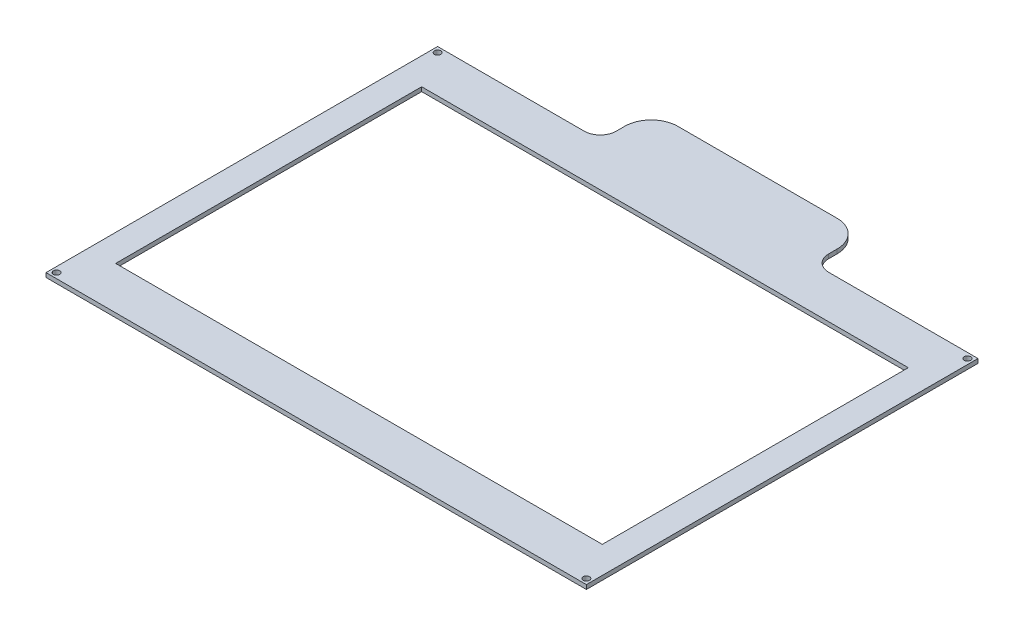
ISO-10303-21;
HEADER;
FILE_DESCRIPTION(('STEP AP214'),'2;1');
FILE_NAME('part.step','',(''),(''),'','','');
FILE_SCHEMA(('AUTOMOTIVE_DESIGN { 1 0 10303 214 1 1 1 1 }'));
ENDSEC;
DATA;
#1=APPLICATION_CONTEXT('core data for automotive mechanical design processes');
#2=APPLICATION_PROTOCOL_DEFINITION('international standard','automotive_design',2000,#1);
#3=PRODUCT_CONTEXT('',#1,'mechanical');
#4=PRODUCT('Part','Part','',(#3));
#5=PRODUCT_RELATED_PRODUCT_CATEGORY('part','',(#4));
#6=PRODUCT_DEFINITION_FORMATION('','',#4);
#7=PRODUCT_DEFINITION_CONTEXT('part definition',#1,'design');
#8=PRODUCT_DEFINITION('design','',#6,#7);
#9=PRODUCT_DEFINITION_SHAPE('','',#8);
#10=(LENGTH_UNIT() NAMED_UNIT(*) SI_UNIT(.MILLI.,.METRE.));
#11=(NAMED_UNIT(*) PLANE_ANGLE_UNIT() SI_UNIT($,.RADIAN.));
#12=(NAMED_UNIT(*) SI_UNIT($,.STERADIAN.) SOLID_ANGLE_UNIT());
#13=UNCERTAINTY_MEASURE_WITH_UNIT(LENGTH_MEASURE(1.E-05),#10,'distance_accuracy_value','');
#14=(GEOMETRIC_REPRESENTATION_CONTEXT(3) GLOBAL_UNCERTAINTY_ASSIGNED_CONTEXT((#13)) GLOBAL_UNIT_ASSIGNED_CONTEXT((#10,
#11,#12)) REPRESENTATION_CONTEXT('',''));
#15=CARTESIAN_POINT('',(0.,0.,0.));
#16=DIRECTION('',(0.,0.,1.));
#17=DIRECTION('',(1.,0.,0.));
#18=AXIS2_PLACEMENT_3D('',#15,#16,#17);
#19=CARTESIAN_POINT('',(-58.1227979298154,2.,-87.6413871869836));
#20=DIRECTION('',(0.,1.,0.));
#21=DIRECTION('',(0.,0.,1.));
#22=AXIS2_PLACEMENT_3D('',#19,#20,#21);
#23=PLANE('',#22);
#24=CARTESIAN_POINT('',(124.667766953022,2.,101.667766953043));
#25=DIRECTION('',(0.,1.,0.));
#26=DIRECTION('',(0.,0.,1.));
#27=AXIS2_PLACEMENT_3D('',#24,#25,#26);
#28=CIRCLE('',#27,1.49999999999998);
#29=CARTESIAN_POINT('',(124.667766953022,2.,103.167766953043));
#30=VERTEX_POINT('',#29);
#31=EDGE_CURVE('E188',#30,#30,#28,.T.);
#32=ORIENTED_EDGE('',*,*,#31,.F.);
#33=EDGE_LOOP('',(#32));
#34=FACE_BOUND('',#33,.T.);
#35=CARTESIAN_POINT('',(-124.667766952911,2.,-77.6591541398728));
#36=DIRECTION('',(0.,1.,0.));
#37=DIRECTION('',(0.,0.,1.));
#38=AXIS2_PLACEMENT_3D('',#35,#36,#37);
#39=CIRCLE('',#38,1.5);
#40=CARTESIAN_POINT('',(-124.667766952911,2.,-76.1591541398728));
#41=VERTEX_POINT('',#40);
#42=EDGE_CURVE('E200',#41,#41,#39,.T.);
#43=ORIENTED_EDGE('',*,*,#42,.F.);
#44=EDGE_LOOP('',(#43));
#45=FACE_BOUND('',#44,.T.);
#46=DIRECTION('',(0.,0.,1.));
#47=VECTOR('',#46,1.);
#48=CARTESIAN_POINT('',(-127.15,2.,104.141387186984));
#49=LINE('',#48,#47);
#50=CARTESIAN_POINT('',(-127.15,2.,-80.1413871869836));
#51=VERTEX_POINT('',#50);
#52=CARTESIAN_POINT('',(-127.15,2.,104.141387186984));
#53=VERTEX_POINT('',#52);
#54=EDGE_CURVE('E206',#51,#53,#49,.T.);
#55=ORIENTED_EDGE('',*,*,#54,.T.);
#56=DIRECTION('',(1.,0.,0.));
#57=VECTOR('',#56,1.);
#58=CARTESIAN_POINT('',(127.15,2.,104.141387186984));
#59=LINE('',#58,#57);
#60=CARTESIAN_POINT('',(127.15,2.,104.141387186984));
#61=VERTEX_POINT('',#60);
#62=EDGE_CURVE('E209',#53,#61,#59,.T.);
#63=ORIENTED_EDGE('',*,*,#62,.T.);
#64=DIRECTION('',(0.,0.,-1.));
#65=VECTOR('',#64,1.);
#66=CARTESIAN_POINT('',(127.15,2.,-80.1413871869836));
#67=LINE('',#66,#65);
#68=CARTESIAN_POINT('',(127.15,2.,-80.1413871869836));
#69=VERTEX_POINT('',#68);
#70=EDGE_CURVE('E212',#61,#69,#67,.T.);
#71=ORIENTED_EDGE('',*,*,#70,.T.);
#72=DIRECTION('',(-1.,0.,0.));
#73=VECTOR('',#72,1.);
#74=CARTESIAN_POINT('',(56.8772020701845,2.,-80.1413871869836));
#75=LINE('',#74,#73);
#76=CARTESIAN_POINT('',(56.8772020701846,2.,-80.1413871869836));
#77=VERTEX_POINT('',#76);
#78=EDGE_CURVE('E214',#69,#77,#75,.T.);
#79=ORIENTED_EDGE('',*,*,#78,.T.);
#80=CARTESIAN_POINT('',(56.8772020701846,2.,-87.6413871869836));
#81=DIRECTION('',(0.,-1.,0.));
#82=DIRECTION('',(0.,0.,1.));
#83=AXIS2_PLACEMENT_3D('',#80,#81,#82);
#84=CIRCLE('',#83,7.50000000000001);
#85=CARTESIAN_POINT('',(49.3772020701845,2.,-87.6413871869836));
#86=VERTEX_POINT('',#85);
#87=EDGE_CURVE('E216',#77,#86,#84,.T.);
#88=ORIENTED_EDGE('',*,*,#87,.T.);
#89=DIRECTION('',(0.,0.,-1.));
#90=VECTOR('',#89,1.);
#91=CARTESIAN_POINT('',(49.3772020701845,2.,-91.6413871869836));
#92=LINE('',#91,#90);
#93=CARTESIAN_POINT('',(49.3772020701846,2.,-91.6413871869836));
#94=VERTEX_POINT('',#93);
#95=EDGE_CURVE('E218',#86,#94,#92,.T.);
#96=ORIENTED_EDGE('',*,*,#95,.T.);
#97=CARTESIAN_POINT('',(36.8772020701846,2.,-91.6413871869836));
#98=DIRECTION('',(0.,1.,0.));
#99=DIRECTION('',(0.,0.,-1.));
#100=AXIS2_PLACEMENT_3D('',#97,#98,#99);
#101=CIRCLE('',#100,12.5);
#102=CARTESIAN_POINT('',(36.8772020701846,2.,-104.141387186984));
#103=VERTEX_POINT('',#102);
#104=EDGE_CURVE('E220',#94,#103,#101,.T.);
#105=ORIENTED_EDGE('',*,*,#104,.T.);
#106=DIRECTION('',(-1.,0.,0.));
#107=VECTOR('',#106,1.);
#108=CARTESIAN_POINT('',(-38.1227979298154,2.,-104.141387186984));
#109=LINE('',#108,#107);
#110=CARTESIAN_POINT('',(-38.1227979298154,2.,-104.141387186984));
#111=VERTEX_POINT('',#110);
#112=EDGE_CURVE('E222',#103,#111,#109,.T.);
#113=ORIENTED_EDGE('',*,*,#112,.T.);
#114=CARTESIAN_POINT('',(-38.1227979298154,2.,-91.6413871869835));
#115=DIRECTION('',(0.,1.,0.));
#116=DIRECTION('',(0.,0.,-1.));
#117=AXIS2_PLACEMENT_3D('',#114,#115,#116);
#118=CIRCLE('',#117,12.5000000000001);
#119=CARTESIAN_POINT('',(-50.6227979298154,2.,-91.6413871869835));
#120=VERTEX_POINT('',#119);
#121=EDGE_CURVE('E224',#111,#120,#118,.T.);
#122=ORIENTED_EDGE('',*,*,#121,.T.);
#123=DIRECTION('',(0.,0.,1.));
#124=VECTOR('',#123,1.);
#125=CARTESIAN_POINT('',(-50.6227979298154,2.,-91.6413871869835));
#126=LINE('',#125,#124);
#127=CARTESIAN_POINT('',(-50.6227979298154,2.,-87.6413871869836));
#128=VERTEX_POINT('',#127);
#129=EDGE_CURVE('E226',#120,#128,#126,.T.);
#130=ORIENTED_EDGE('',*,*,#129,.T.);
#131=CARTESIAN_POINT('',(-58.1227979298154,2.,-87.6413871869836));
#132=DIRECTION('',(0.,-1.,0.));
#133=DIRECTION('',(0.,0.,1.));
#134=AXIS2_PLACEMENT_3D('',#131,#132,#133);
#135=CIRCLE('',#134,7.5);
#136=CARTESIAN_POINT('',(-58.1227979298154,2.,-80.1413871869836));
#137=VERTEX_POINT('',#136);
#138=EDGE_CURVE('E228',#128,#137,#135,.T.);
#139=ORIENTED_EDGE('',*,*,#138,.T.);
#140=DIRECTION('',(-1.,0.,0.));
#141=VECTOR('',#140,1.);
#142=CARTESIAN_POINT('',(-127.15,2.,-80.1413871869836));
#143=LINE('',#142,#141);
#144=EDGE_CURVE('E230',#137,#51,#143,.T.);
#145=ORIENTED_EDGE('',*,*,#144,.T.);
#146=EDGE_LOOP('',(#55,#63,#71,#79,#88,#96,#105,#113,#122,#130,#139,#145));
#147=FACE_BOUND('',#146,.T.);
#148=CARTESIAN_POINT('',(124.667766953022,2.,-77.6591541398728));
#149=DIRECTION('',(0.,1.,0.));
#150=DIRECTION('',(0.,0.,1.));
#151=AXIS2_PLACEMENT_3D('',#148,#149,#150);
#152=CIRCLE('',#151,1.49999999999998);
#153=CARTESIAN_POINT('',(124.667766953022,2.,-76.1591541398729));
#154=VERTEX_POINT('',#153);
#155=EDGE_CURVE('E194',#154,#154,#152,.T.);
#156=ORIENTED_EDGE('',*,*,#155,.F.);
#157=EDGE_LOOP('',(#156));
#158=FACE_BOUND('',#157,.T.);
#159=CARTESIAN_POINT('',(-124.667766952911,2.,101.667766953043));
#160=DIRECTION('',(0.,1.,0.));
#161=DIRECTION('',(0.,0.,1.));
#162=AXIS2_PLACEMENT_3D('',#159,#160,#161);
#163=CIRCLE('',#162,1.5);
#164=CARTESIAN_POINT('',(-124.667766952911,2.,103.167766953043));
#165=VERTEX_POINT('',#164);
#166=EDGE_CURVE('E182',#165,#165,#163,.T.);
#167=ORIENTED_EDGE('',*,*,#166,.F.);
#168=EDGE_LOOP('',(#167));
#169=FACE_BOUND('',#168,.T.);
#170=DIRECTION('',(-1.,0.,0.));
#171=VECTOR('',#170,1.);
#172=CARTESIAN_POINT('',(-114.5,2.,-59.9913871869836));
#173=LINE('',#172,#171);
#174=CARTESIAN_POINT('',(114.5,2.,-59.9913871869836));
#175=VERTEX_POINT('',#174);
#176=CARTESIAN_POINT('',(-114.5,2.,-59.9913871869836));
#177=VERTEX_POINT('',#176);
#178=EDGE_CURVE('E154',#175,#177,#173,.T.);
#179=ORIENTED_EDGE('',*,*,#178,.F.);
#180=DIRECTION('',(0.,0.,-1.));
#181=VECTOR('',#180,1.);
#182=CARTESIAN_POINT('',(114.5,2.,-59.9913871869836));
#183=LINE('',#182,#181);
#184=CARTESIAN_POINT('',(114.5,2.,84.0086128130164));
#185=VERTEX_POINT('',#184);
#186=EDGE_CURVE('E146',#185,#175,#183,.T.);
#187=ORIENTED_EDGE('',*,*,#186,.F.);
#188=DIRECTION('',(1.,0.,0.));
#189=VECTOR('',#188,1.);
#190=CARTESIAN_POINT('',(-114.5,2.,84.0086128130164));
#191=LINE('',#190,#189);
#192=CARTESIAN_POINT('',(-114.5,2.,84.0086128130164));
#193=VERTEX_POINT('',#192);
#194=EDGE_CURVE('E168',#193,#185,#191,.T.);
#195=ORIENTED_EDGE('',*,*,#194,.F.);
#196=DIRECTION('',(0.,0.,1.));
#197=VECTOR('',#196,1.);
#198=CARTESIAN_POINT('',(-114.5,2.,-59.9913871869836));
#199=LINE('',#198,#197);
#200=EDGE_CURVE('E166',#177,#193,#199,.T.);
#201=ORIENTED_EDGE('',*,*,#200,.F.);
#202=EDGE_LOOP('',(#179,#187,#195,#201));
#203=FACE_BOUND('',#202,.T.);
#204=ADVANCED_FACE('F33',(#34,#45,#147,#158,#169,#203),#23,.T.);
#205=CARTESIAN_POINT('',(-58.1227979298154,0.,-87.6413871869836));
#206=DIRECTION('',(0.,1.,0.));
#207=DIRECTION('',(0.,0.,1.));
#208=AXIS2_PLACEMENT_3D('',#205,#206,#207);
#209=PLANE('',#208);
#210=CARTESIAN_POINT('',(-124.667766952911,0.,101.667766953043));
#211=DIRECTION('',(0.,1.,0.));
#212=DIRECTION('',(0.,0.,1.));
#213=AXIS2_PLACEMENT_3D('',#210,#211,#212);
#214=CIRCLE('',#213,1.5);
#215=CARTESIAN_POINT('',(-124.667766952911,0.,103.167766953043));
#216=VERTEX_POINT('',#215);
#217=EDGE_CURVE('E162',#216,#216,#214,.T.);
#218=ORIENTED_EDGE('',*,*,#217,.T.);
#219=EDGE_LOOP('',(#218));
#220=FACE_BOUND('',#219,.T.);
#221=CARTESIAN_POINT('',(124.667766953022,0.,101.667766953043));
#222=DIRECTION('',(0.,1.,0.));
#223=DIRECTION('',(0.,0.,1.));
#224=AXIS2_PLACEMENT_3D('',#221,#222,#223);
#225=CIRCLE('',#224,1.49999999999998);
#226=CARTESIAN_POINT('',(124.667766953022,0.,103.167766953043));
#227=VERTEX_POINT('',#226);
#228=EDGE_CURVE('E185',#227,#227,#225,.T.);
#229=ORIENTED_EDGE('',*,*,#228,.T.);
#230=EDGE_LOOP('',(#229));
#231=FACE_BOUND('',#230,.T.);
#232=CARTESIAN_POINT('',(124.667766953022,0.,-77.6591541398728));
#233=DIRECTION('',(0.,1.,0.));
#234=DIRECTION('',(0.,0.,1.));
#235=AXIS2_PLACEMENT_3D('',#232,#233,#234);
#236=CIRCLE('',#235,1.49999999999998);
#237=CARTESIAN_POINT('',(124.667766953022,0.,-76.1591541398729));
#238=VERTEX_POINT('',#237);
#239=EDGE_CURVE('E191',#238,#238,#236,.T.);
#240=ORIENTED_EDGE('',*,*,#239,.T.);
#241=EDGE_LOOP('',(#240));
#242=FACE_BOUND('',#241,.T.);
#243=CARTESIAN_POINT('',(-124.667766952911,0.,-77.6591541398728));
#244=DIRECTION('',(0.,1.,0.));
#245=DIRECTION('',(0.,0.,1.));
#246=AXIS2_PLACEMENT_3D('',#243,#244,#245);
#247=CIRCLE('',#246,1.5);
#248=CARTESIAN_POINT('',(-124.667766952911,0.,-76.1591541398728));
#249=VERTEX_POINT('',#248);
#250=EDGE_CURVE('E197',#249,#249,#247,.T.);
#251=ORIENTED_EDGE('',*,*,#250,.T.);
#252=EDGE_LOOP('',(#251));
#253=FACE_BOUND('',#252,.T.);
#254=DIRECTION('',(0.,0.,1.));
#255=VECTOR('',#254,1.);
#256=CARTESIAN_POINT('',(-127.15,0.,104.141387186984));
#257=LINE('',#256,#255);
#258=CARTESIAN_POINT('',(-127.15,0.,-80.1413871869836));
#259=VERTEX_POINT('',#258);
#260=CARTESIAN_POINT('',(-127.15,0.,104.141387186984));
#261=VERTEX_POINT('',#260);
#262=EDGE_CURVE('E203',#259,#261,#257,.T.);
#263=ORIENTED_EDGE('',*,*,#262,.F.);
#264=DIRECTION('',(-1.,0.,0.));
#265=VECTOR('',#264,1.);
#266=CARTESIAN_POINT('',(-127.15,0.,-80.1413871869836));
#267=LINE('',#266,#265);
#268=CARTESIAN_POINT('',(-58.1227979298154,0.,-80.1413871869836));
#269=VERTEX_POINT('',#268);
#270=EDGE_CURVE('E210',#269,#259,#267,.T.);
#271=ORIENTED_EDGE('',*,*,#270,.F.);
#272=CARTESIAN_POINT('',(-58.1227979298154,0.,-87.6413871869836));
#273=DIRECTION('',(0.,-1.,0.));
#274=DIRECTION('',(0.,0.,1.));
#275=AXIS2_PLACEMENT_3D('',#272,#273,#274);
#276=CIRCLE('',#275,7.5);
#277=CARTESIAN_POINT('',(-50.6227979298154,0.,-87.6413871869836));
#278=VERTEX_POINT('',#277);
#279=EDGE_CURVE('E253',#278,#269,#276,.T.);
#280=ORIENTED_EDGE('',*,*,#279,.F.);
#281=DIRECTION('',(0.,0.,1.));
#282=VECTOR('',#281,1.);
#283=CARTESIAN_POINT('',(-50.6227979298154,0.,-91.6413871869835));
#284=LINE('',#283,#282);
#285=CARTESIAN_POINT('',(-50.6227979298154,0.,-91.6413871869835));
#286=VERTEX_POINT('',#285);
#287=EDGE_CURVE('E251',#286,#278,#284,.T.);
#288=ORIENTED_EDGE('',*,*,#287,.F.);
#289=CARTESIAN_POINT('',(-38.1227979298154,0.,-91.6413871869835));
#290=DIRECTION('',(0.,1.,0.));
#291=DIRECTION('',(0.,0.,-1.));
#292=AXIS2_PLACEMENT_3D('',#289,#290,#291);
#293=CIRCLE('',#292,12.5000000000001);
#294=CARTESIAN_POINT('',(-38.1227979298154,0.,-104.141387186984));
#295=VERTEX_POINT('',#294);
#296=EDGE_CURVE('E249',#295,#286,#293,.T.);
#297=ORIENTED_EDGE('',*,*,#296,.F.);
#298=DIRECTION('',(-1.,0.,0.));
#299=VECTOR('',#298,1.);
#300=CARTESIAN_POINT('',(-38.1227979298154,0.,-104.141387186984));
#301=LINE('',#300,#299);
#302=CARTESIAN_POINT('',(36.8772020701846,0.,-104.141387186984));
#303=VERTEX_POINT('',#302);
#304=EDGE_CURVE('E247',#303,#295,#301,.T.);
#305=ORIENTED_EDGE('',*,*,#304,.F.);
#306=CARTESIAN_POINT('',(36.8772020701846,0.,-91.6413871869836));
#307=DIRECTION('',(0.,1.,0.));
#308=DIRECTION('',(0.,0.,-1.));
#309=AXIS2_PLACEMENT_3D('',#306,#307,#308);
#310=CIRCLE('',#309,12.5);
#311=CARTESIAN_POINT('',(49.3772020701846,0.,-91.6413871869836));
#312=VERTEX_POINT('',#311);
#313=EDGE_CURVE('E245',#312,#303,#310,.T.);
#314=ORIENTED_EDGE('',*,*,#313,.F.);
#315=DIRECTION('',(0.,0.,-1.));
#316=VECTOR('',#315,1.);
#317=CARTESIAN_POINT('',(49.3772020701845,0.,-91.6413871869836));
#318=LINE('',#317,#316);
#319=CARTESIAN_POINT('',(49.3772020701845,0.,-87.6413871869836));
#320=VERTEX_POINT('',#319);
#321=EDGE_CURVE('E243',#320,#312,#318,.T.);
#322=ORIENTED_EDGE('',*,*,#321,.F.);
#323=CARTESIAN_POINT('',(56.8772020701846,0.,-87.6413871869836));
#324=DIRECTION('',(0.,-1.,0.));
#325=DIRECTION('',(0.,0.,1.));
#326=AXIS2_PLACEMENT_3D('',#323,#324,#325);
#327=CIRCLE('',#326,7.50000000000001);
#328=CARTESIAN_POINT('',(56.8772020701846,0.,-80.1413871869836));
#329=VERTEX_POINT('',#328);
#330=EDGE_CURVE('E241',#329,#320,#327,.T.);
#331=ORIENTED_EDGE('',*,*,#330,.F.);
#332=DIRECTION('',(-1.,0.,0.));
#333=VECTOR('',#332,1.);
#334=CARTESIAN_POINT('',(56.8772020701845,0.,-80.1413871869836));
#335=LINE('',#334,#333);
#336=CARTESIAN_POINT('',(127.15,0.,-80.1413871869836));
#337=VERTEX_POINT('',#336);
#338=EDGE_CURVE('E239',#337,#329,#335,.T.);
#339=ORIENTED_EDGE('',*,*,#338,.F.);
#340=DIRECTION('',(0.,0.,-1.));
#341=VECTOR('',#340,1.);
#342=CARTESIAN_POINT('',(127.15,0.,-80.1413871869836));
#343=LINE('',#342,#341);
#344=CARTESIAN_POINT('',(127.15,0.,104.141387186984));
#345=VERTEX_POINT('',#344);
#346=EDGE_CURVE('E237',#345,#337,#343,.T.);
#347=ORIENTED_EDGE('',*,*,#346,.F.);
#348=DIRECTION('',(1.,0.,0.));
#349=VECTOR('',#348,1.);
#350=CARTESIAN_POINT('',(127.15,0.,104.141387186984));
#351=LINE('',#350,#349);
#352=EDGE_CURVE('E235',#261,#345,#351,.T.);
#353=ORIENTED_EDGE('',*,*,#352,.F.);
#354=EDGE_LOOP('',(#263,#271,#280,#288,#297,#305,#314,#322,#331,#339,#347,#353));
#355=FACE_BOUND('',#354,.T.);
#356=DIRECTION('',(0.,0.,-1.));
#357=VECTOR('',#356,1.);
#358=CARTESIAN_POINT('',(114.5,0.,-59.9913871869836));
#359=LINE('',#358,#357);
#360=CARTESIAN_POINT('',(114.5,0.,84.0086128130164));
#361=VERTEX_POINT('',#360);
#362=CARTESIAN_POINT('',(114.5,0.,-59.9913871869836));
#363=VERTEX_POINT('',#362);
#364=EDGE_CURVE('E56',#361,#363,#359,.T.);
#365=ORIENTED_EDGE('',*,*,#364,.T.);
#366=DIRECTION('',(-1.,0.,0.));
#367=VECTOR('',#366,1.);
#368=CARTESIAN_POINT('',(-114.5,0.,-59.9913871869836));
#369=LINE('',#368,#367);
#370=CARTESIAN_POINT('',(-114.5,0.,-59.9913871869836));
#371=VERTEX_POINT('',#370);
#372=EDGE_CURVE('E161',#363,#371,#369,.T.);
#373=ORIENTED_EDGE('',*,*,#372,.T.);
#374=DIRECTION('',(0.,0.,1.));
#375=VECTOR('',#374,1.);
#376=CARTESIAN_POINT('',(-114.5,0.,-59.9913871869836));
#377=LINE('',#376,#375);
#378=CARTESIAN_POINT('',(-114.5,0.,84.0086128130164));
#379=VERTEX_POINT('',#378);
#380=EDGE_CURVE('E174',#371,#379,#377,.T.);
#381=ORIENTED_EDGE('',*,*,#380,.T.);
#382=DIRECTION('',(1.,0.,0.));
#383=VECTOR('',#382,1.);
#384=CARTESIAN_POINT('',(-114.5,0.,84.0086128130164));
#385=LINE('',#384,#383);
#386=EDGE_CURVE('E155',#379,#361,#385,.T.);
#387=ORIENTED_EDGE('',*,*,#386,.T.);
#388=EDGE_LOOP('',(#365,#373,#381,#387));
#389=FACE_BOUND('',#388,.T.);
#390=ADVANCED_FACE('F295',(#220,#231,#242,#253,#355,#389),#209,.F.);
#391=CARTESIAN_POINT('',(-127.15,2.,104.141387186984));
#392=DIRECTION('',(1.,0.,0.));
#393=DIRECTION('',(0.,0.,-1.));
#394=AXIS2_PLACEMENT_3D('',#391,#392,#393);
#395=PLANE('',#394);
#396=ORIENTED_EDGE('',*,*,#262,.T.);
#397=DIRECTION('',(0.,-1.,0.));
#398=VECTOR('',#397,1.);
#399=CARTESIAN_POINT('',(-127.15,2.,104.141387186984));
#400=LINE('',#399,#398);
#401=EDGE_CURVE('E11',#53,#261,#400,.T.);
#402=ORIENTED_EDGE('',*,*,#401,.F.);
#403=ORIENTED_EDGE('',*,*,#54,.F.);
#404=DIRECTION('',(0.,-1.,0.));
#405=VECTOR('',#404,1.);
#406=CARTESIAN_POINT('',(-127.15,2.,-80.1413871869836));
#407=LINE('',#406,#405);
#408=EDGE_CURVE('E232',#51,#259,#407,.T.);
#409=ORIENTED_EDGE('',*,*,#408,.T.);
#410=EDGE_LOOP('',(#396,#402,#403,#409));
#411=FACE_BOUND('',#410,.T.);
#412=ADVANCED_FACE('F35',(#411),#395,.F.);
#413=CARTESIAN_POINT('',(127.15,2.,104.141387186984));
#414=DIRECTION('',(0.,0.,-1.));
#415=DIRECTION('',(-1.,0.,0.));
#416=AXIS2_PLACEMENT_3D('',#413,#414,#415);
#417=PLANE('',#416);
#418=ORIENTED_EDGE('',*,*,#352,.T.);
#419=DIRECTION('',(0.,-1.,0.));
#420=VECTOR('',#419,1.);
#421=CARTESIAN_POINT('',(127.15,2.,104.141387186984));
#422=LINE('',#421,#420);
#423=EDGE_CURVE('E41',#61,#345,#422,.T.);
#424=ORIENTED_EDGE('',*,*,#423,.F.);
#425=ORIENTED_EDGE('',*,*,#62,.F.);
#426=ORIENTED_EDGE('',*,*,#401,.T.);
#427=EDGE_LOOP('',(#418,#424,#425,#426));
#428=FACE_BOUND('',#427,.T.);
#429=ADVANCED_FACE('F313',(#428),#417,.F.);
#430=CARTESIAN_POINT('',(127.15,2.,-80.1413871869836));
#431=DIRECTION('',(-1.,0.,0.));
#432=DIRECTION('',(0.,0.,1.));
#433=AXIS2_PLACEMENT_3D('',#430,#431,#432);
#434=PLANE('',#433);
#435=ORIENTED_EDGE('',*,*,#346,.T.);
#436=DIRECTION('',(0.,-1.,0.));
#437=VECTOR('',#436,1.);
#438=CARTESIAN_POINT('',(127.15,2.,-80.1413871869836));
#439=LINE('',#438,#437);
#440=EDGE_CURVE('E282',#69,#337,#439,.T.);
#441=ORIENTED_EDGE('',*,*,#440,.F.);
#442=ORIENTED_EDGE('',*,*,#70,.F.);
#443=ORIENTED_EDGE('',*,*,#423,.T.);
#444=EDGE_LOOP('',(#435,#441,#442,#443));
#445=FACE_BOUND('',#444,.T.);
#446=ADVANCED_FACE('F289',(#445),#434,.F.);
#447=CARTESIAN_POINT('',(56.8772020701845,2.,-80.1413871869836));
#448=DIRECTION('',(0.,0.,1.));
#449=DIRECTION('',(1.,0.,0.));
#450=AXIS2_PLACEMENT_3D('',#447,#448,#449);
#451=PLANE('',#450);
#452=ORIENTED_EDGE('',*,*,#338,.T.);
#453=DIRECTION('',(0.,-1.,0.));
#454=VECTOR('',#453,1.);
#455=CARTESIAN_POINT('',(56.8772020701846,2.,-80.1413871869836));
#456=LINE('',#455,#454);
#457=EDGE_CURVE('E279',#77,#329,#456,.T.);
#458=ORIENTED_EDGE('',*,*,#457,.F.);
#459=ORIENTED_EDGE('',*,*,#78,.F.);
#460=ORIENTED_EDGE('',*,*,#440,.T.);
#461=EDGE_LOOP('',(#452,#458,#459,#460));
#462=FACE_BOUND('',#461,.T.);
#463=ADVANCED_FACE('F301',(#462),#451,.F.);
#464=CARTESIAN_POINT('',(56.8772020701846,2.,-87.6413871869836));
#465=DIRECTION('',(0.,-1.,0.));
#466=DIRECTION('',(0.,0.,-1.));
#467=AXIS2_PLACEMENT_3D('',#464,#465,#466);
#468=CYLINDRICAL_SURFACE('',#467,7.50000000000001);
#469=ORIENTED_EDGE('',*,*,#330,.T.);
#470=DIRECTION('',(0.,-1.,0.));
#471=VECTOR('',#470,1.);
#472=CARTESIAN_POINT('',(49.3772020701845,2.,-87.6413871869836));
#473=LINE('',#472,#471);
#474=EDGE_CURVE('E276',#86,#320,#473,.T.);
#475=ORIENTED_EDGE('',*,*,#474,.F.);
#476=ORIENTED_EDGE('',*,*,#87,.F.);
#477=ORIENTED_EDGE('',*,*,#457,.T.);
#478=EDGE_LOOP('',(#469,#475,#476,#477));
#479=FACE_BOUND('',#478,.T.);
#480=ADVANCED_FACE('F305',(#479),#468,.F.);
#481=CARTESIAN_POINT('',(49.3772020701845,2.,-91.6413871869836));
#482=DIRECTION('',(-1.,0.,0.));
#483=DIRECTION('',(0.,0.,1.));
#484=AXIS2_PLACEMENT_3D('',#481,#482,#483);
#485=PLANE('',#484);
#486=ORIENTED_EDGE('',*,*,#321,.T.);
#487=DIRECTION('',(0.,-1.,0.));
#488=VECTOR('',#487,1.);
#489=CARTESIAN_POINT('',(49.3772020701846,2.,-91.6413871869836));
#490=LINE('',#489,#488);
#491=EDGE_CURVE('E273',#94,#312,#490,.T.);
#492=ORIENTED_EDGE('',*,*,#491,.F.);
#493=ORIENTED_EDGE('',*,*,#95,.F.);
#494=ORIENTED_EDGE('',*,*,#474,.T.);
#495=EDGE_LOOP('',(#486,#492,#493,#494));
#496=FACE_BOUND('',#495,.T.);
#497=ADVANCED_FACE('F346',(#496),#485,.F.);
#498=CARTESIAN_POINT('',(36.8772020701846,2.,-91.6413871869836));
#499=DIRECTION('',(0.,-1.,0.));
#500=DIRECTION('',(0.,0.,-1.));
#501=AXIS2_PLACEMENT_3D('',#498,#499,#500);
#502=CYLINDRICAL_SURFACE('',#501,12.5);
#503=ORIENTED_EDGE('',*,*,#313,.T.);
#504=DIRECTION('',(0.,-1.,0.));
#505=VECTOR('',#504,1.);
#506=CARTESIAN_POINT('',(36.8772020701846,2.,-104.141387186984));
#507=LINE('',#506,#505);
#508=EDGE_CURVE('E270',#103,#303,#507,.T.);
#509=ORIENTED_EDGE('',*,*,#508,.F.);
#510=ORIENTED_EDGE('',*,*,#104,.F.);
#511=ORIENTED_EDGE('',*,*,#491,.T.);
#512=EDGE_LOOP('',(#503,#509,#510,#511));
#513=FACE_BOUND('',#512,.T.);
#514=ADVANCED_FACE('F344',(#513),#502,.T.);
#515=CARTESIAN_POINT('',(-38.1227979298154,2.,-104.141387186984));
#516=DIRECTION('',(0.,0.,1.));
#517=DIRECTION('',(1.,0.,0.));
#518=AXIS2_PLACEMENT_3D('',#515,#516,#517);
#519=PLANE('',#518);
#520=ORIENTED_EDGE('',*,*,#304,.T.);
#521=DIRECTION('',(0.,-1.,0.));
#522=VECTOR('',#521,1.);
#523=CARTESIAN_POINT('',(-38.1227979298154,2.,-104.141387186984));
#524=LINE('',#523,#522);
#525=EDGE_CURVE('E267',#111,#295,#524,.T.);
#526=ORIENTED_EDGE('',*,*,#525,.F.);
#527=ORIENTED_EDGE('',*,*,#112,.F.);
#528=ORIENTED_EDGE('',*,*,#508,.T.);
#529=EDGE_LOOP('',(#520,#526,#527,#528));
#530=FACE_BOUND('',#529,.T.);
#531=ADVANCED_FACE('F340',(#530),#519,.F.);
#532=CARTESIAN_POINT('',(-38.1227979298154,2.,-91.6413871869835));
#533=DIRECTION('',(0.,-1.,0.));
#534=DIRECTION('',(0.,0.,-1.));
#535=AXIS2_PLACEMENT_3D('',#532,#533,#534);
#536=CYLINDRICAL_SURFACE('',#535,12.5000000000001);
#537=ORIENTED_EDGE('',*,*,#296,.T.);
#538=DIRECTION('',(0.,-1.,0.));
#539=VECTOR('',#538,1.);
#540=CARTESIAN_POINT('',(-50.6227979298154,2.,-91.6413871869835));
#541=LINE('',#540,#539);
#542=EDGE_CURVE('E264',#120,#286,#541,.T.);
#543=ORIENTED_EDGE('',*,*,#542,.F.);
#544=ORIENTED_EDGE('',*,*,#121,.F.);
#545=ORIENTED_EDGE('',*,*,#525,.T.);
#546=EDGE_LOOP('',(#537,#543,#544,#545));
#547=FACE_BOUND('',#546,.T.);
#548=ADVANCED_FACE('F335',(#547),#536,.T.);
#549=CARTESIAN_POINT('',(-50.6227979298154,2.,-91.6413871869835));
#550=DIRECTION('',(1.,0.,0.));
#551=DIRECTION('',(0.,0.,-1.));
#552=AXIS2_PLACEMENT_3D('',#549,#550,#551);
#553=PLANE('',#552);
#554=ORIENTED_EDGE('',*,*,#287,.T.);
#555=DIRECTION('',(0.,-1.,0.));
#556=VECTOR('',#555,1.);
#557=CARTESIAN_POINT('',(-50.6227979298154,2.,-87.6413871869836));
#558=LINE('',#557,#556);
#559=EDGE_CURVE('E261',#128,#278,#558,.T.);
#560=ORIENTED_EDGE('',*,*,#559,.F.);
#561=ORIENTED_EDGE('',*,*,#129,.F.);
#562=ORIENTED_EDGE('',*,*,#542,.T.);
#563=EDGE_LOOP('',(#554,#560,#561,#562));
#564=FACE_BOUND('',#563,.T.);
#565=ADVANCED_FACE('F329',(#564),#553,.F.);
#566=CARTESIAN_POINT('',(-58.1227979298154,2.,-87.6413871869836));
#567=DIRECTION('',(0.,-1.,0.));
#568=DIRECTION('',(0.,0.,-1.));
#569=AXIS2_PLACEMENT_3D('',#566,#567,#568);
#570=CYLINDRICAL_SURFACE('',#569,7.5);
#571=ORIENTED_EDGE('',*,*,#279,.T.);
#572=DIRECTION('',(0.,-1.,0.));
#573=VECTOR('',#572,1.);
#574=CARTESIAN_POINT('',(-58.1227979298154,2.,-80.1413871869836));
#575=LINE('',#574,#573);
#576=EDGE_CURVE('E258',#137,#269,#575,.T.);
#577=ORIENTED_EDGE('',*,*,#576,.F.);
#578=ORIENTED_EDGE('',*,*,#138,.F.);
#579=ORIENTED_EDGE('',*,*,#559,.T.);
#580=EDGE_LOOP('',(#571,#577,#578,#579));
#581=FACE_BOUND('',#580,.T.);
#582=ADVANCED_FACE('F325',(#581),#570,.F.);
#583=CARTESIAN_POINT('',(-127.15,2.,-80.1413871869836));
#584=DIRECTION('',(0.,0.,1.));
#585=DIRECTION('',(1.,0.,0.));
#586=AXIS2_PLACEMENT_3D('',#583,#584,#585);
#587=PLANE('',#586);
#588=ORIENTED_EDGE('',*,*,#270,.T.);
#589=ORIENTED_EDGE('',*,*,#408,.F.);
#590=ORIENTED_EDGE('',*,*,#144,.F.);
#591=ORIENTED_EDGE('',*,*,#576,.T.);
#592=EDGE_LOOP('',(#588,#589,#590,#591));
#593=FACE_BOUND('',#592,.T.);
#594=ADVANCED_FACE('F320',(#593),#587,.F.);
#595=CARTESIAN_POINT('',(-124.667766952911,2.,-77.6591541398728));
#596=DIRECTION('',(0.,-1.,0.));
#597=DIRECTION('',(0.,0.,-1.));
#598=AXIS2_PLACEMENT_3D('',#595,#596,#597);
#599=CYLINDRICAL_SURFACE('',#598,1.5);
#600=ORIENTED_EDGE('',*,*,#42,.T.);
#601=EDGE_LOOP('',(#600));
#602=FACE_BOUND('',#601,.T.);
#603=ORIENTED_EDGE('',*,*,#250,.F.);
#604=EDGE_LOOP('',(#603));
#605=FACE_BOUND('',#604,.T.);
#606=ADVANCED_FACE('F366',(#602,#605),#599,.F.);
#607=CARTESIAN_POINT('',(124.667766953022,2.,-77.6591541398728));
#608=DIRECTION('',(0.,-1.,0.));
#609=DIRECTION('',(0.,0.,-1.));
#610=AXIS2_PLACEMENT_3D('',#607,#608,#609);
#611=CYLINDRICAL_SURFACE('',#610,1.49999999999998);
#612=ORIENTED_EDGE('',*,*,#155,.T.);
#613=EDGE_LOOP('',(#612));
#614=FACE_BOUND('',#613,.T.);
#615=ORIENTED_EDGE('',*,*,#239,.F.);
#616=EDGE_LOOP('',(#615));
#617=FACE_BOUND('',#616,.T.);
#618=ADVANCED_FACE('F404',(#614,#617),#611,.F.);
#619=CARTESIAN_POINT('',(124.667766953022,2.,101.667766953043));
#620=DIRECTION('',(0.,-1.,0.));
#621=DIRECTION('',(0.,0.,-1.));
#622=AXIS2_PLACEMENT_3D('',#619,#620,#621);
#623=CYLINDRICAL_SURFACE('',#622,1.49999999999998);
#624=ORIENTED_EDGE('',*,*,#31,.T.);
#625=EDGE_LOOP('',(#624));
#626=FACE_BOUND('',#625,.T.);
#627=ORIENTED_EDGE('',*,*,#228,.F.);
#628=EDGE_LOOP('',(#627));
#629=FACE_BOUND('',#628,.T.);
#630=ADVANCED_FACE('F411',(#626,#629),#623,.F.);
#631=CARTESIAN_POINT('',(-124.667766952911,2.,101.667766953043));
#632=DIRECTION('',(0.,-1.,0.));
#633=DIRECTION('',(0.,0.,-1.));
#634=AXIS2_PLACEMENT_3D('',#631,#632,#633);
#635=CYLINDRICAL_SURFACE('',#634,1.5);
#636=ORIENTED_EDGE('',*,*,#166,.T.);
#637=EDGE_LOOP('',(#636));
#638=FACE_BOUND('',#637,.T.);
#639=ORIENTED_EDGE('',*,*,#217,.F.);
#640=EDGE_LOOP('',(#639));
#641=FACE_BOUND('',#640,.T.);
#642=ADVANCED_FACE('F418',(#638,#641),#635,.F.);
#643=CARTESIAN_POINT('',(114.5,2.,-59.9913871869836));
#644=DIRECTION('',(-1.,0.,0.));
#645=DIRECTION('',(0.,0.,1.));
#646=AXIS2_PLACEMENT_3D('',#643,#644,#645);
#647=PLANE('',#646);
#648=ORIENTED_EDGE('',*,*,#364,.F.);
#649=DIRECTION('',(0.,-1.,0.));
#650=VECTOR('',#649,1.);
#651=CARTESIAN_POINT('',(114.5,2.,84.0086128130164));
#652=LINE('',#651,#650);
#653=EDGE_CURVE('E150',#185,#361,#652,.T.);
#654=ORIENTED_EDGE('',*,*,#653,.F.);
#655=ORIENTED_EDGE('',*,*,#186,.T.);
#656=DIRECTION('',(0.,-1.,0.));
#657=VECTOR('',#656,1.);
#658=CARTESIAN_POINT('',(114.5,2.,-59.9913871869836));
#659=LINE('',#658,#657);
#660=EDGE_CURVE('E149',#175,#363,#659,.T.);
#661=ORIENTED_EDGE('',*,*,#660,.T.);
#662=EDGE_LOOP('',(#648,#654,#655,#661));
#663=FACE_BOUND('',#662,.T.);
#664=ADVANCED_FACE('F148',(#663),#647,.T.);
#665=CARTESIAN_POINT('',(-114.5,2.,-59.9913871869836));
#666=DIRECTION('',(0.,0.,1.));
#667=DIRECTION('',(1.,0.,0.));
#668=AXIS2_PLACEMENT_3D('',#665,#666,#667);
#669=PLANE('',#668);
#670=ORIENTED_EDGE('',*,*,#372,.F.);
#671=ORIENTED_EDGE('',*,*,#660,.F.);
#672=ORIENTED_EDGE('',*,*,#178,.T.);
#673=DIRECTION('',(0.,-1.,0.));
#674=VECTOR('',#673,1.);
#675=CARTESIAN_POINT('',(-114.5,2.,-59.9913871869836));
#676=LINE('',#675,#674);
#677=EDGE_CURVE('E163',#177,#371,#676,.T.);
#678=ORIENTED_EDGE('',*,*,#677,.T.);
#679=EDGE_LOOP('',(#670,#671,#672,#678));
#680=FACE_BOUND('',#679,.T.);
#681=ADVANCED_FACE('F158',(#680),#669,.T.);
#682=CARTESIAN_POINT('',(-114.5,2.,-59.9913871869836));
#683=DIRECTION('',(1.,0.,0.));
#684=DIRECTION('',(0.,0.,-1.));
#685=AXIS2_PLACEMENT_3D('',#682,#683,#684);
#686=PLANE('',#685);
#687=ORIENTED_EDGE('',*,*,#380,.F.);
#688=ORIENTED_EDGE('',*,*,#677,.F.);
#689=ORIENTED_EDGE('',*,*,#200,.T.);
#690=DIRECTION('',(0.,-1.,0.));
#691=VECTOR('',#690,1.);
#692=CARTESIAN_POINT('',(-114.5,2.,84.0086128130164));
#693=LINE('',#692,#691);
#694=EDGE_CURVE('E48',#193,#379,#693,.T.);
#695=ORIENTED_EDGE('',*,*,#694,.T.);
#696=EDGE_LOOP('',(#687,#688,#689,#695));
#697=FACE_BOUND('',#696,.T.);
#698=ADVANCED_FACE('F439',(#697),#686,.T.);
#699=CARTESIAN_POINT('',(-114.5,2.,84.0086128130164));
#700=DIRECTION('',(0.,0.,-1.));
#701=DIRECTION('',(-1.,0.,0.));
#702=AXIS2_PLACEMENT_3D('',#699,#700,#701);
#703=PLANE('',#702);
#704=ORIENTED_EDGE('',*,*,#386,.F.);
#705=ORIENTED_EDGE('',*,*,#694,.F.);
#706=ORIENTED_EDGE('',*,*,#194,.T.);
#707=ORIENTED_EDGE('',*,*,#653,.T.);
#708=EDGE_LOOP('',(#704,#705,#706,#707));
#709=FACE_BOUND('',#708,.T.);
#710=ADVANCED_FACE('F446',(#709),#703,.T.);
#711=CLOSED_SHELL('',(#204,#390,#412,#429,#446,#463,#480,#497,#514,#531,#548,#565,#582,#594,
#606,#618,#630,#642,#664,#681,#698,#710));
#712=MANIFOLD_SOLID_BREP('B2',#711);
#713=ADVANCED_BREP_SHAPE_REPRESENTATION('',(#18,#712),#14);
#714=SHAPE_DEFINITION_REPRESENTATION(#9,#713);
ENDSEC;
END-ISO-10303-21;
